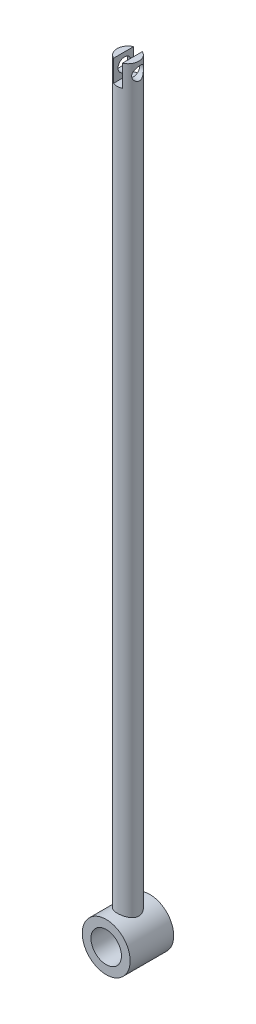
ISO-10303-21;
HEADER;
FILE_DESCRIPTION(('STEP AP214'),'2;1');
FILE_NAME('part.step','',(''),(''),'','','');
FILE_SCHEMA(('AUTOMOTIVE_DESIGN { 1 0 10303 214 1 1 1 1 }'));
ENDSEC;
DATA;
#1=APPLICATION_CONTEXT('core data for automotive mechanical design processes');
#2=APPLICATION_PROTOCOL_DEFINITION('international standard','automotive_design',2000,#1);
#3=PRODUCT_CONTEXT('',#1,'mechanical');
#4=PRODUCT('Part','Part','',(#3));
#5=PRODUCT_RELATED_PRODUCT_CATEGORY('part','',(#4));
#6=PRODUCT_DEFINITION_FORMATION('','',#4);
#7=PRODUCT_DEFINITION_CONTEXT('part definition',#1,'design');
#8=PRODUCT_DEFINITION('design','',#6,#7);
#9=PRODUCT_DEFINITION_SHAPE('','',#8);
#10=(LENGTH_UNIT() NAMED_UNIT(*) SI_UNIT(.MILLI.,.METRE.));
#11=(NAMED_UNIT(*) PLANE_ANGLE_UNIT() SI_UNIT($,.RADIAN.));
#12=(NAMED_UNIT(*) SI_UNIT($,.STERADIAN.) SOLID_ANGLE_UNIT());
#13=UNCERTAINTY_MEASURE_WITH_UNIT(LENGTH_MEASURE(1.E-05),#10,'distance_accuracy_value','');
#14=(GEOMETRIC_REPRESENTATION_CONTEXT(3) GLOBAL_UNCERTAINTY_ASSIGNED_CONTEXT((#13)) GLOBAL_UNIT_ASSIGNED_CONTEXT((#10,
#11,#12)) REPRESENTATION_CONTEXT('',''));
#15=CARTESIAN_POINT('',(0.,0.,0.));
#16=DIRECTION('',(0.,0.,1.));
#17=DIRECTION('',(1.,0.,0.));
#18=AXIS2_PLACEMENT_3D('',#15,#16,#17);
#19=CARTESIAN_POINT('',(0.,170.,5.));
#20=DIRECTION('',(0.,-1.,0.));
#21=DIRECTION('',(0.,0.,-1.));
#22=AXIS2_PLACEMENT_3D('',#19,#20,#21);
#23=CYLINDRICAL_SURFACE('',#22,2.5);
#24=CARTESIAN_POINT('',(0.,170.,5.));
#25=DIRECTION('',(0.,1.,0.));
#26=DIRECTION('',(0.,0.,1.));
#27=AXIS2_PLACEMENT_3D('',#24,#25,#26);
#28=CIRCLE('',#27,2.5);
#29=CARTESIAN_POINT('',(-1.,170.,7.29128784747792));
#30=VERTEX_POINT('',#29);
#31=CARTESIAN_POINT('',(1.,170.,7.29128784747792));
#32=VERTEX_POINT('',#31);
#33=EDGE_CURVE('E124',#30,#32,#28,.T.);
#34=ORIENTED_EDGE('',*,*,#33,.F.);
#35=DIRECTION('',(0.,-1.,0.));
#36=VECTOR('',#35,1.);
#37=CARTESIAN_POINT('',(-1.,175.,7.29128784747792));
#38=LINE('',#37,#36);
#39=CARTESIAN_POINT('',(-1.,175.,7.29128784747792));
#40=VERTEX_POINT('',#39);
#41=EDGE_CURVE('E120',#40,#30,#38,.T.);
#42=ORIENTED_EDGE('',*,*,#41,.F.);
#43=CARTESIAN_POINT('',(0.,175.,5.));
#44=DIRECTION('',(0.,1.,0.));
#45=DIRECTION('',(0.,0.,1.));
#46=AXIS2_PLACEMENT_3D('',#43,#44,#45);
#47=CIRCLE('',#46,2.5);
#48=CARTESIAN_POINT('',(-1.,175.,2.70871215252208));
#49=VERTEX_POINT('',#48);
#50=EDGE_CURVE('E106',#49,#40,#47,.T.);
#51=ORIENTED_EDGE('',*,*,#50,.F.);
#52=DIRECTION('',(0.,-1.,0.));
#53=VECTOR('',#52,1.);
#54=CARTESIAN_POINT('',(-1.,175.,2.70871215252208));
#55=LINE('',#54,#53);
#56=CARTESIAN_POINT('',(-1.,170.,2.70871215252208));
#57=VERTEX_POINT('',#56);
#58=EDGE_CURVE('E116',#49,#57,#55,.T.);
#59=ORIENTED_EDGE('',*,*,#58,.T.);
#60=CARTESIAN_POINT('',(1.,170.,2.70871215252208));
#61=VERTEX_POINT('',#60);
#62=EDGE_CURVE('E101',#61,#57,#28,.T.);
#63=ORIENTED_EDGE('',*,*,#62,.F.);
#64=DIRECTION('',(0.,-1.,0.));
#65=VECTOR('',#64,1.);
#66=CARTESIAN_POINT('',(1.,175.,2.70871215252208));
#67=LINE('',#66,#65);
#68=CARTESIAN_POINT('',(1.,175.,2.70871215252208));
#69=VERTEX_POINT('',#68);
#70=EDGE_CURVE('E58',#69,#61,#67,.T.);
#71=ORIENTED_EDGE('',*,*,#70,.F.);
#72=CARTESIAN_POINT('',(0.,175.,5.));
#73=DIRECTION('',(0.,1.,0.));
#74=DIRECTION('',(0.,0.,1.));
#75=AXIS2_PLACEMENT_3D('',#72,#73,#74);
#76=CIRCLE('',#75,2.5);
#77=CARTESIAN_POINT('',(1.,175.,7.29128784747792));
#78=VERTEX_POINT('',#77);
#79=EDGE_CURVE('E91',#78,#69,#76,.T.);
#80=ORIENTED_EDGE('',*,*,#79,.F.);
#81=DIRECTION('',(0.,-1.,0.));
#82=VECTOR('',#81,1.);
#83=CARTESIAN_POINT('',(1.,175.,7.29128784747792));
#84=LINE('',#83,#82);
#85=EDGE_CURVE('E87',#78,#32,#84,.T.);
#86=ORIENTED_EDGE('',*,*,#85,.T.);
#87=EDGE_LOOP('',(#34,#42,#51,#59,#63,#71,#80,#86));
#88=FACE_BOUND('',#87,.T.);
#89=CARTESIAN_POINT('',(0.,5.5,2.5));
#90=CARTESIAN_POINT('',(-0.132816145284357,5.49999369870931,2.50000770657968));
#91=CARTESIAN_POINT('',(-0.265835701448803,5.49513526114601,2.51064708851472));
#92=CARTESIAN_POINT('',(-0.528027896062537,5.47618102046917,2.55277708585043));
#93=CARTESIAN_POINT('',(-0.657190881556424,5.46206378775658,2.58431607542101));
#94=CARTESIAN_POINT('',(-0.907466739557298,5.42608787981103,2.66680544715223));
#95=CARTESIAN_POINT('',(-1.02860698228922,5.40425732698846,2.71768536363404));
#96=CARTESIAN_POINT('',(-1.26049169700434,5.35492606344154,2.83708941935535));
#97=CARTESIAN_POINT('',(-1.37123824747009,5.32742648991282,2.90561002058932));
#98=CARTESIAN_POINT('',(-1.58575279564469,5.26767788661504,3.06248592473316));
#99=CARTESIAN_POINT('',(-1.68884771841108,5.23525516065229,3.15169467760791));
#100=CARTESIAN_POINT('',(-1.87921167122033,5.169981608249,3.34559891012303));
#101=CARTESIAN_POINT('',(-1.96647083094001,5.13713052839629,3.45030397520704));
#102=CARTESIAN_POINT('',(-2.12798843737884,5.07244492450594,3.6799449421281));
#103=CARTESIAN_POINT('',(-2.20112759491811,5.04079497957299,3.80572580705089));
#104=CARTESIAN_POINT('',(-2.32491325493927,4.98491966737432,4.06943201918799));
#105=CARTESIAN_POINT('',(-2.37557345021863,4.96068978306032,4.20734991174338));
#106=CARTESIAN_POINT('',(-2.45005627758752,4.9243140427224,4.48369548563305));
#107=CARTESIAN_POINT('',(-2.47518302941619,4.91158514421169,4.62169158073497));
#108=CARTESIAN_POINT('',(-2.50193279260797,4.89801821463239,4.90048194541598));
#109=CARTESIAN_POINT('',(-2.50357264087074,4.89717166555205,5.04127413806362));
#110=CARTESIAN_POINT('',(-2.48427141198996,4.90698153027191,5.30741072026334));
#111=CARTESIAN_POINT('',(-2.46545016283118,4.91655818122591,5.43295732955884));
#112=CARTESIAN_POINT('',(-2.4093676508794,4.94428109958009,5.6788660765093));
#113=CARTESIAN_POINT('',(-2.37210198697065,4.96242941226084,5.79922696931906));
#114=CARTESIAN_POINT('',(-2.27945184779561,5.0056720821879,6.03463657988821));
#115=CARTESIAN_POINT('',(-2.22367420519436,5.03091516285485,6.14950198601082));
#116=CARTESIAN_POINT('',(-2.09586859273949,5.08548488907163,6.3687414552682));
#117=CARTESIAN_POINT('',(-2.02383365211919,5.11481328424216,6.47311099017509));
#118=CARTESIAN_POINT('',(-1.85692478057703,5.17789221587211,6.67964656522397));
#119=CARTESIAN_POINT('',(-1.76046753299936,5.2117880598316,6.78049273353465));
#120=CARTESIAN_POINT('',(-1.55174815249174,5.27769368397502,6.96506827328681));
#121=CARTESIAN_POINT('',(-1.43948082103431,5.30970283886444,7.04879199238651));
#122=CARTESIAN_POINT('',(-1.19766281925566,5.36950534618767,7.19920668395963));
#123=CARTESIAN_POINT('',(-1.06767206685173,5.39712978524095,7.26526247902372));
#124=CARTESIAN_POINT('',(-0.796844896081458,5.44369936052484,7.37408839587899));
#125=CARTESIAN_POINT('',(-0.656015701378205,5.46265022004357,7.41687387617979));
#126=CARTESIAN_POINT('',(-0.378449914355492,5.48860490400602,7.47495536936345));
#127=CARTESIAN_POINT('',(-0.242154484202898,5.49637394767751,7.49201639920862));
#128=CARTESIAN_POINT('',(0.0315660436282488,5.50161007334277,7.50354688446092));
#129=CARTESIAN_POINT('',(0.168990715716221,5.49908087348691,7.49802449354217));
#130=CARTESIAN_POINT('',(0.432146778493067,5.48448407938737,7.4657141909571));
#131=CARTESIAN_POINT('',(0.558078127396233,5.47301153257062,7.44025247846056));
#132=CARTESIAN_POINT('',(0.803693463481533,5.44237110560927,7.37073267387439));
#133=CARTESIAN_POINT('',(0.923376701955515,5.42320230560714,7.32667235884421));
#134=CARTESIAN_POINT('',(1.15732747516372,5.37821815950354,7.21983025191788));
#135=CARTESIAN_POINT('',(1.27131180951637,5.35221506502489,7.15651006512357));
#136=CARTESIAN_POINT('',(1.48744614928834,5.29622400098564,7.013532445334));
#137=CARTESIAN_POINT('',(1.58959093424205,5.26623428600456,6.93386784808692));
#138=CARTESIAN_POINT('',(1.78819128612951,5.2023213866395,6.75268934687502));
#139=CARTESIAN_POINT('',(1.88345063650186,5.16827928194194,6.64990310925036));
#140=CARTESIAN_POINT('',(2.05579555974773,5.10218027178943,6.42943763375986));
#141=CARTESIAN_POINT('',(2.13287371467411,5.0701241805496,6.31175234705524));
#142=CARTESIAN_POINT('',(2.26851417742739,5.01093675854131,6.06054583116627));
#143=CARTESIAN_POINT('',(2.32651178086012,4.98396428661225,5.92667925579803));
#144=CARTESIAN_POINT('',(2.41857144488097,4.93995555801825,5.6494505865758));
#145=CARTESIAN_POINT('',(2.45265831910444,4.9229090037493,5.50609850603875));
#146=CARTESIAN_POINT('',(2.49325807507769,4.90246200756536,5.2274373803254));
#147=CARTESIAN_POINT('',(2.5019188531559,4.89799994349808,5.09251907739777));
#148=CARTESIAN_POINT('',(2.49737021161822,4.90032179261342,4.82316690852988));
#149=CARTESIAN_POINT('',(2.48416607010203,4.90710299172004,4.68873293352526));
#150=CARTESIAN_POINT('',(2.4381684933062,4.93010341873286,4.43337370386282));
#151=CARTESIAN_POINT('',(2.40671995185147,4.94567287009982,4.31214138124329));
#152=CARTESIAN_POINT('',(2.32658661605855,4.98386936157557,4.07670718572974));
#153=CARTESIAN_POINT('',(2.2778967772596,5.00649846696794,3.96250738190245));
#154=CARTESIAN_POINT('',(2.1610419547488,5.05808484439916,3.73621296097084));
#155=CARTESIAN_POINT('',(2.09181431853015,5.08735847849273,3.62474088289736));
#156=CARTESIAN_POINT('',(1.93719380028804,5.14822130854099,3.41433129072047));
#157=CARTESIAN_POINT('',(1.85179378769227,5.17981152212113,3.31539933793318));
#158=CARTESIAN_POINT('',(1.65784520472974,5.2452790147138,3.12333979866508));
#159=CARTESIAN_POINT('',(1.54788097332246,5.27909503785502,3.03161259442945));
#160=CARTESIAN_POINT('',(1.31300676588176,5.34236067072088,2.86773851077349));
#161=CARTESIAN_POINT('',(1.18808990453652,5.3718082548044,2.79560070214091));
#162=CARTESIAN_POINT('',(0.927398695048436,5.42285296457391,2.67397870975514));
#163=CARTESIAN_POINT('',(0.791729654695489,5.44451694348196,2.6243006157715));
#164=CARTESIAN_POINT('',(0.582817222347262,5.46948623676269,2.56781082539488));
#165=CARTESIAN_POINT('',(0.512336727590824,5.4765522405717,2.55199091419621));
#166=CARTESIAN_POINT('',(0.370074071775207,5.48799750884364,2.52648988951803));
#167=CARTESIAN_POINT('',(0.298292830256239,5.49237860050235,2.51680460101854));
#168=CARTESIAN_POINT('',(0.18861229497853,5.49689395714262,2.50683913684737));
#169=CARTESIAN_POINT('',(0.150946407387661,5.49805724033138,2.50427613909589));
#170=CARTESIAN_POINT('',(0.0755258311084194,5.49961116371431,2.50085546170958));
#171=CARTESIAN_POINT('',(0.0377711410607123,5.50000179200306,2.49999780835148));
#172=CARTESIAN_POINT('',(0.,5.5,2.5));
#173=B_SPLINE_CURVE_WITH_KNOTS('',3,(#89,#90,#91,#92,#93,#94,#95,#96,#97,#98,#99,#100,#101,#102,
#103,#104,#105,#106,#107,#108,#109,#110,#111,#112,#113,#114,#115,#116,#117,#118,#119,#120,#121,
#122,#123,#124,#125,#126,#127,#128,#129,#130,#131,#132,#133,#134,#135,#136,#137,#138,#139,#140,
#141,#142,#143,#144,#145,#146,#147,#148,#149,#150,#151,#152,#153,#154,#155,#156,#157,#158,#159,
#160,#161,#162,#163,#164,#165,#166,#167,#168,#169,#170,#171,#172),.UNSPECIFIED.,.T.,.F.,(4,2,2,
2,2,2,2,2,2,2,2,2,2,2,2,2,2,2,2,2,2,2,2,2,2,2,2,2,2,2,2,2,2,2,2,2,2,2,2,2,2,4),(0.,
0.398300931001202,0.797527003400661,1.19531228574912,1.59301785057736,2.01163405819865,
2.43051029696777,2.8749655137827,3.31914962297436,3.73929338084823,4.15913593798615,
4.53929253779887,4.91953989247825,5.30844370198958,5.6975145826618,6.1264236824533,
6.55547414294633,6.99833839939004,7.44091000768855,7.85145915894037,8.26186009578161,
8.6470684559661,9.03232287003282,9.42952911220836,9.8269098353609,10.2576285831247,
10.6885227618009,11.1312140224167,11.5734451926766,11.9770599127743,12.3805772161773,
12.7575667492601,13.1346666732434,13.5363493613727,13.9382095697602,14.3775242869152,
14.8170420813821,15.2526891454276,15.4701654657451,15.6874936194379,15.800763348909,
15.9140348236778),.UNSPECIFIED.);
#174=CARTESIAN_POINT('',(0.,5.5,2.5));
#175=VERTEX_POINT('',#174);
#176=EDGE_CURVE('E11',#175,#175,#173,.T.);
#177=ORIENTED_EDGE('',*,*,#176,.T.);
#178=EDGE_LOOP('',(#177));
#179=FACE_BOUND('',#178,.T.);
#180=CARTESIAN_POINT('',(-2.14069514292807,172.5,6.29128784747793));
#181=CARTESIAN_POINT('',(-2.14070141830382,172.578027632267,6.29128329138601));
#182=CARTESIAN_POINT('',(-2.14443172397127,172.656186680594,6.28515447906656));
#183=CARTESIAN_POINT('',(-2.15873931679595,172.81009087785,6.26096392507642));
#184=CARTESIAN_POINT('',(-2.16933502272238,172.885828956453,6.2428700804453));
#185=CARTESIAN_POINT('',(-2.1956532071937,173.032320807087,6.1957520457726));
#186=CARTESIAN_POINT('',(-2.21134433875949,173.103101917198,6.16679452391612));
#187=CARTESIAN_POINT('',(-2.24584632739405,173.238829145625,6.09891758617039));
#188=CARTESIAN_POINT('',(-2.26465708655064,173.303775446973,6.05999848291304));
#189=CARTESIAN_POINT('',(-2.30512689765842,173.43252867305,5.96906352136546));
#190=CARTESIAN_POINT('',(-2.32688911323996,173.495688327511,5.91617548523756));
#191=CARTESIAN_POINT('',(-2.36917081031949,173.612761413411,5.8005135365687));
#192=CARTESIAN_POINT('',(-2.38968965860018,173.666670158761,5.73773464447404));
#193=CARTESIAN_POINT('',(-2.42806664392425,173.766398912422,5.59988886945598));
#194=CARTESIAN_POINT('',(-2.44573030621819,173.811650724033,5.52435200419287));
#195=CARTESIAN_POINT('',(-2.47444945856696,173.888541251422,5.36549693614796));
#196=CARTESIAN_POINT('',(-2.48551185963301,173.920194194406,5.2821869772682));
#197=CARTESIAN_POINT('',(-2.49833844508071,173.965844524357,5.11945144185434));
#198=CARTESIAN_POINT('',(-2.50094225336532,173.981323467121,5.04050822693958));
#199=CARTESIAN_POINT('',(-2.49844626996597,173.999435374382,4.88129709342823));
#200=CARTESIAN_POINT('',(-2.49335062264703,174.002075246506,4.80102991047837));
#201=CARTESIAN_POINT('',(-2.4763295237764,173.995009006545,4.64912658957882));
#202=CARTESIAN_POINT('',(-2.46505698287968,173.986387980334,4.57736154606894));
#203=CARTESIAN_POINT('',(-2.43681120920132,173.959289269121,4.43689597817315));
#204=CARTESIAN_POINT('',(-2.41983684353516,173.9408096249,4.36819606586755));
#205=CARTESIAN_POINT('',(-2.3803052558832,173.893887131649,4.23228763258643));
#206=CARTESIAN_POINT('',(-2.35753078598515,173.865032556234,4.1652860852334));
#207=CARTESIAN_POINT('',(-2.30820672936686,173.798701231144,4.03724529411199));
#208=CARTESIAN_POINT('',(-2.28165622583113,173.761222386139,3.97620750442491));
#209=CARTESIAN_POINT('',(-2.22219304070417,173.672563579143,3.85228885977368));
#210=CARTESIAN_POINT('',(-2.18891761237375,173.620181796299,3.79044207151836));
#211=CARTESIAN_POINT('',(-2.12165986951438,173.50631144035,3.67599880862024));
#212=CARTESIAN_POINT('',(-2.08767623758627,173.444804291757,3.62342169247748));
#213=CARTESIAN_POINT('',(-2.01763308900464,173.305112313312,3.52237359163978));
#214=CARTESIAN_POINT('',(-1.98184913319329,173.225803028469,3.47524826358308));
#215=CARTESIAN_POINT('',(-1.9179617268387,173.057409660917,3.39561844701404));
#216=CARTESIAN_POINT('',(-1.88983206881609,172.968360433648,3.36306381662737));
#217=CARTESIAN_POINT('',(-1.85459969626499,172.815092336877,3.32342567272736));
#218=CARTESIAN_POINT('',(-1.84358512812127,172.753045179876,3.31141857434128));
#219=CARTESIAN_POINT('',(-1.82873407058471,172.627120917551,3.29534231177016));
#220=CARTESIAN_POINT('',(-1.82488719788205,172.563246595615,3.29126166475668));
#221=CARTESIAN_POINT('',(-1.8249365170057,172.435414412714,3.29131432726677));
#222=CARTESIAN_POINT('',(-1.82884380541813,172.371456563111,3.2954594082115));
#223=CARTESIAN_POINT('',(-1.84382994385271,172.245385444588,3.31168522876542));
#224=CARTESIAN_POINT('',(-1.85491831054758,172.183274737989,3.32377649932006));
#225=CARTESIAN_POINT('',(-1.88630447936951,172.047301412972,3.35910477956824));
#226=CARTESIAN_POINT('',(-1.90820364940758,171.974341333442,3.38436144790111));
#227=CARTESIAN_POINT('',(-1.95771307392423,171.834734127828,3.44472576812642));
#228=CARTESIAN_POINT('',(-1.98533132720073,171.768096036183,3.47984724187368));
#229=CARTESIAN_POINT('',(-2.04399165011587,171.640435903258,3.5596532600339));
#230=CARTESIAN_POINT('',(-2.07509013107739,171.579549235452,3.60451144896121));
#231=CARTESIAN_POINT('',(-2.13783016478279,171.465315226709,3.7026642745302));
#232=CARTESIAN_POINT('',(-2.16947191572369,171.411970705798,3.75596205104588));
#233=CARTESIAN_POINT('',(-2.2375279195485,171.303453308029,3.88214770508867));
#234=CARTESIAN_POINT('',(-2.27360532483994,171.250111822915,3.95681558127685));
#235=CARTESIAN_POINT('',(-2.34026588714046,171.157192363301,4.1164793295706));
#236=CARTESIAN_POINT('',(-2.3708551789316,171.11759897384,4.20146348931704));
#237=CARTESIAN_POINT('',(-2.41765252451377,171.061602919094,4.35957010283165));
#238=CARTESIAN_POINT('',(-2.43554779760682,171.04198654959,4.43105810258579));
#239=CARTESIAN_POINT('',(-2.46514416227022,171.013467215756,4.57736822904704));
#240=CARTESIAN_POINT('',(-2.4768504476628,171.004555260225,4.65218750277577));
#241=CARTESIAN_POINT('',(-2.49341215667729,170.998137680654,4.80330383085204));
#242=CARTESIAN_POINT('',(-2.49824741460185,171.000665540716,4.87960457160536));
#243=CARTESIAN_POINT('',(-2.50095442492037,171.017328718079,5.03105915946419));
#244=CARTESIAN_POINT('',(-2.49882525965686,171.031465564836,5.10621285411995));
#245=CARTESIAN_POINT('',(-2.4884880927595,171.06993645159,5.2497584555153));
#246=CARTESIAN_POINT('',(-2.48055685929708,171.093784986095,5.31830245455973));
#247=CARTESIAN_POINT('',(-2.45996284598952,171.150757626301,5.45063515250131));
#248=CARTESIAN_POINT('',(-2.44729925799655,171.183883316027,5.51442303696007));
#249=CARTESIAN_POINT('',(-2.41750229297507,171.261138194188,5.64044766305601));
#250=CARTESIAN_POINT('',(-2.40011268490799,171.305888038785,5.70224182578551));
#251=CARTESIAN_POINT('',(-2.3631636522671,171.403834849555,5.81802083107956));
#252=CARTESIAN_POINT('',(-2.34360257054352,171.457038280584,5.87199963599639));
#253=CARTESIAN_POINT('',(-2.30187437252361,171.577652088917,5.97721197922381));
#254=CARTESIAN_POINT('',(-2.27967302308833,171.645998814883,6.02736298251089));
#255=CARTESIAN_POINT('',(-2.23775300854055,171.790756522194,6.11573338687229));
#256=CARTESIAN_POINT('',(-2.21803429646778,171.867167350951,6.15395301365445));
#257=CARTESIAN_POINT('',(-2.18623474008605,172.015959811978,6.21299341231143));
#258=CARTESIAN_POINT('',(-2.17349124869877,172.087554874629,6.23543897990486));
#259=CARTESIAN_POINT('',(-2.1538364361929,172.233948285747,6.26940333757745));
#260=CARTESIAN_POINT('',(-2.14690752450749,172.308736248141,6.28095509738783));
#261=CARTESIAN_POINT('',(-2.14249861806857,172.403297927718,6.28829336353644));
#262=CARTESIAN_POINT('',(-2.1418239191606,172.422611738351,6.28941508870397));
#263=CARTESIAN_POINT('',(-2.14092137167742,172.461280997951,6.29091294815256));
#264=CARTESIAN_POINT('',(-2.1406935856139,172.480636452365,6.29128897812998));
#265=CARTESIAN_POINT('',(-2.14069514292807,172.5,6.29128784747793));
#266=B_SPLINE_CURVE_WITH_KNOTS('',3,(#180,#181,#182,#183,#184,#185,#186,#187,#188,#189,#190,
#191,#192,#193,#194,#195,#196,#197,#198,#199,#200,#201,#202,#203,#204,#205,#206,#207,#208,#209,
#210,#211,#212,#213,#214,#215,#216,#217,#218,#219,#220,#221,#222,#223,#224,#225,#226,#227,#228,
#229,#230,#231,#232,#233,#234,#235,#236,#237,#238,#239,#240,#241,#242,#243,#244,#245,#246,#247,
#248,#249,#250,#251,#252,#253,#254,#255,#256,#257,#258,#259,#260,#261,#262,#263,#264,#265),
.UNSPECIFIED.,.T.,.F.,(4,2,2,2,2,2,2,2,2,2,2,2,2,2,2,2,2,2,2,2,2,2,2,2,2,2,2,2,2,2,2,2,2,2,2,2,
2,2,2,2,2,2,4),(0.,0.23399896488917,0.468628325535289,0.701840760412903,0.935045877104088,
1.18957619904431,1.44423507624161,1.71216991200239,1.97982374627568,2.21993712000256,
2.45992129459154,2.67840129022264,2.89692472092292,3.12530286379603,3.35373655151683,
3.61555117243449,3.87790624426834,4.173220743506,4.46751101809187,4.65916323090611,
4.85053759484437,5.04218602240172,5.23408895183829,5.47355313688869,5.71335453012613,
5.95784726157174,6.20243116902311,6.49671829167429,6.7906743732143,7.01847903056038,
7.2460922086828,7.47437203601842,7.70268194353769,7.92075763220176,8.13887057885025,
8.37269213109375,8.60669336603062,8.86841225566174,9.13012619401263,9.357504783203,
9.58419298942111,9.64225468278683,9.70032449692314),.UNSPECIFIED.);
#267=CARTESIAN_POINT('',(-2.14069514292807,172.5,6.29128784747793));
#268=VERTEX_POINT('',#267);
#269=EDGE_CURVE('E146',#268,#268,#266,.T.);
#270=ORIENTED_EDGE('',*,*,#269,.F.);
#271=EDGE_LOOP('',(#270));
#272=FACE_BOUND('',#271,.T.);
#273=CARTESIAN_POINT('',(2.14069514292807,172.5,6.29128784747793));
#274=CARTESIAN_POINT('',(2.14070141830382,172.421972367733,6.29128329138601));
#275=CARTESIAN_POINT('',(2.14443172397127,172.343813319406,6.28515447906656));
#276=CARTESIAN_POINT('',(2.15873931679595,172.18990912215,6.26096392507642));
#277=CARTESIAN_POINT('',(2.16933502272238,172.114171043548,6.24287008044529));
#278=CARTESIAN_POINT('',(2.1956532071937,171.967679192913,6.1957520457726));
#279=CARTESIAN_POINT('',(2.21134433875949,171.896898082802,6.16679452391612));
#280=CARTESIAN_POINT('',(2.24584632739405,171.761170854375,6.09891758617039));
#281=CARTESIAN_POINT('',(2.26465708655064,171.696224553027,6.05999848291304));
#282=CARTESIAN_POINT('',(2.30512689765842,171.56747132695,5.96906352136546));
#283=CARTESIAN_POINT('',(2.32688911323996,171.504311672489,5.91617548523756));
#284=CARTESIAN_POINT('',(2.36917081031949,171.387238586589,5.8005135365687));
#285=CARTESIAN_POINT('',(2.38968965860018,171.333329841239,5.73773464447404));
#286=CARTESIAN_POINT('',(2.42806664392425,171.233601087578,5.59988886945598));
#287=CARTESIAN_POINT('',(2.44573030621819,171.188349275967,5.52435200419287));
#288=CARTESIAN_POINT('',(2.47444945856696,171.111458748578,5.36549693614796));
#289=CARTESIAN_POINT('',(2.48551185963301,171.079805805594,5.2821869772682));
#290=CARTESIAN_POINT('',(2.49833844508071,171.034155475643,5.11945144185434));
#291=CARTESIAN_POINT('',(2.50094225336532,171.018676532879,5.04050822693958));
#292=CARTESIAN_POINT('',(2.49844626996597,171.000564625618,4.88129709342823));
#293=CARTESIAN_POINT('',(2.49335062264703,170.997924753494,4.80102991047837));
#294=CARTESIAN_POINT('',(2.4763295237764,171.004990993455,4.64912658957882));
#295=CARTESIAN_POINT('',(2.46505698287968,171.013612019666,4.57736154606894));
#296=CARTESIAN_POINT('',(2.43681120920132,171.040710730879,4.43689597817315));
#297=CARTESIAN_POINT('',(2.41983684353516,171.0591903751,4.36819606586755));
#298=CARTESIAN_POINT('',(2.3803052558832,171.106112868351,4.23228763258643));
#299=CARTESIAN_POINT('',(2.35753078598515,171.134967443766,4.16528608523342));
#300=CARTESIAN_POINT('',(2.30820672936687,171.201298768856,4.037245294112));
#301=CARTESIAN_POINT('',(2.28165622583113,171.238777613861,3.97620750442491));
#302=CARTESIAN_POINT('',(2.22219304070417,171.327436420857,3.85228885977368));
#303=CARTESIAN_POINT('',(2.18891761237375,171.379818203702,3.79044207151836));
#304=CARTESIAN_POINT('',(2.12165986951438,171.49368855965,3.67599880862024));
#305=CARTESIAN_POINT('',(2.08767623758627,171.555195708243,3.62342169247748));
#306=CARTESIAN_POINT('',(2.01763308900464,171.694887686688,3.52237359163978));
#307=CARTESIAN_POINT('',(1.98184913319329,171.774196971531,3.47524826358308));
#308=CARTESIAN_POINT('',(1.9179617268387,171.942590339083,3.39561844701404));
#309=CARTESIAN_POINT('',(1.88983206881609,172.031639566352,3.36306381662737));
#310=CARTESIAN_POINT('',(1.85459969626499,172.184907663123,3.32342567272736));
#311=CARTESIAN_POINT('',(1.84358512812127,172.246954820124,3.31141857434128));
#312=CARTESIAN_POINT('',(1.82873407058471,172.372879082449,3.29534231177016));
#313=CARTESIAN_POINT('',(1.82488719788205,172.436753404385,3.29126166475668));
#314=CARTESIAN_POINT('',(1.8249365170057,172.564585587286,3.29131432726677));
#315=CARTESIAN_POINT('',(1.82884380541813,172.628543436889,3.2954594082115));
#316=CARTESIAN_POINT('',(1.84382994385271,172.754614555412,3.31168522876542));
#317=CARTESIAN_POINT('',(1.85491831054758,172.816725262011,3.32377649932006));
#318=CARTESIAN_POINT('',(1.88630447936951,172.952698587028,3.35910477956824));
#319=CARTESIAN_POINT('',(1.90820364940758,173.025658666558,3.38436144790111));
#320=CARTESIAN_POINT('',(1.95771307392423,173.165265872172,3.44472576812642));
#321=CARTESIAN_POINT('',(1.98533132720073,173.231903963817,3.47984724187368));
#322=CARTESIAN_POINT('',(2.04399165011587,173.359564096742,3.5596532600339));
#323=CARTESIAN_POINT('',(2.07509013107739,173.420450764548,3.60451144896121));
#324=CARTESIAN_POINT('',(2.13783016478279,173.534684773291,3.7026642745302));
#325=CARTESIAN_POINT('',(2.16947191572369,173.588029294202,3.75596205104587));
#326=CARTESIAN_POINT('',(2.2375279195485,173.696546691971,3.88214770508867));
#327=CARTESIAN_POINT('',(2.27360532483994,173.749888177085,3.95681558127685));
#328=CARTESIAN_POINT('',(2.34026588714046,173.842807636699,4.1164793295706));
#329=CARTESIAN_POINT('',(2.3708551789316,173.88240102616,4.20146348931704));
#330=CARTESIAN_POINT('',(2.41765252451377,173.938397080907,4.35957010283164));
#331=CARTESIAN_POINT('',(2.43554779760682,173.95801345041,4.43105810258578));
#332=CARTESIAN_POINT('',(2.46514416227022,173.986532784244,4.57736822904704));
#333=CARTESIAN_POINT('',(2.4768504476628,173.995444739775,4.65218750277577));
#334=CARTESIAN_POINT('',(2.49341215667729,174.001862319346,4.80330383085204));
#335=CARTESIAN_POINT('',(2.49824741460185,173.999334459284,4.87960457160536));
#336=CARTESIAN_POINT('',(2.50095442492037,173.982671281921,5.03105915946419));
#337=CARTESIAN_POINT('',(2.49882525965686,173.968534435164,5.10621285411995));
#338=CARTESIAN_POINT('',(2.4884880927595,173.93006354841,5.2497584555153));
#339=CARTESIAN_POINT('',(2.48055685929708,173.906215013905,5.31830245455973));
#340=CARTESIAN_POINT('',(2.45996284598952,173.849242373699,5.45063515250131));
#341=CARTESIAN_POINT('',(2.44729925799655,173.816116683973,5.51442303696007));
#342=CARTESIAN_POINT('',(2.41750229297507,173.738861805812,5.64044766305601));
#343=CARTESIAN_POINT('',(2.40011268490799,173.694111961215,5.70224182578551));
#344=CARTESIAN_POINT('',(2.3631636522671,173.596165150445,5.81802083107956));
#345=CARTESIAN_POINT('',(2.34360257054352,173.542961719416,5.87199963599639));
#346=CARTESIAN_POINT('',(2.30187437252361,173.422347911083,5.97721197922382));
#347=CARTESIAN_POINT('',(2.27967302308833,173.354001185117,6.0273629825109));
#348=CARTESIAN_POINT('',(2.23775300854054,173.209243477806,6.1157333868723));
#349=CARTESIAN_POINT('',(2.21803429646778,173.132832649049,6.15395301365446));
#350=CARTESIAN_POINT('',(2.18623474008605,172.984040188022,6.21299341231143));
#351=CARTESIAN_POINT('',(2.17349124869877,172.912445125371,6.23543897990486));
#352=CARTESIAN_POINT('',(2.1538364361929,172.766051714253,6.26940333757745));
#353=CARTESIAN_POINT('',(2.14690752450749,172.691263751859,6.28095509738783));
#354=CARTESIAN_POINT('',(2.14249861806857,172.596702072282,6.28829336353644));
#355=CARTESIAN_POINT('',(2.1418239191606,172.577388261649,6.28941508870396));
#356=CARTESIAN_POINT('',(2.14092137167742,172.538719002049,6.29091294815256));
#357=CARTESIAN_POINT('',(2.1406935856139,172.519363547635,6.29128897812998));
#358=CARTESIAN_POINT('',(2.14069514292807,172.5,6.29128784747793));
#359=B_SPLINE_CURVE_WITH_KNOTS('',3,(#273,#274,#275,#276,#277,#278,#279,#280,#281,#282,#283,
#284,#285,#286,#287,#288,#289,#290,#291,#292,#293,#294,#295,#296,#297,#298,#299,#300,#301,#302,
#303,#304,#305,#306,#307,#308,#309,#310,#311,#312,#313,#314,#315,#316,#317,#318,#319,#320,#321,
#322,#323,#324,#325,#326,#327,#328,#329,#330,#331,#332,#333,#334,#335,#336,#337,#338,#339,#340,
#341,#342,#343,#344,#345,#346,#347,#348,#349,#350,#351,#352,#353,#354,#355,#356,#357,#358),
.UNSPECIFIED.,.T.,.F.,(4,2,2,2,2,2,2,2,2,2,2,2,2,2,2,2,2,2,2,2,2,2,2,2,2,2,2,2,2,2,2,2,2,2,2,2,
2,2,2,2,2,2,4),(0.,0.233998964889198,0.468628325535289,0.701840760412903,0.935045877104088,
1.18957619904431,1.44423507624161,1.71216991200239,1.97982374627568,2.21993712000256,
2.45992129459154,2.67840129022264,2.89692472092292,3.12530286379601,3.35373655151683,
3.61555117243449,3.87790624426834,4.173220743506,4.46751101809187,4.6591632309061,
4.85053759484437,5.04218602240171,5.23408895183829,5.47355313688868,5.71335453012613,
5.95784726157173,6.20243116902311,6.49671829167429,6.7906743732143,7.01847903056037,
7.2460922086828,7.47437203601842,7.70268194353769,7.92075763220176,8.13887057885025,
8.37269213109375,8.60669336603062,8.86841225566177,9.13012619401263,9.357504783203,
9.58419298942111,9.64225468278672,9.70032449692314),.UNSPECIFIED.);
#360=CARTESIAN_POINT('',(2.14069514292807,172.5,6.29128784747793));
#361=VERTEX_POINT('',#360);
#362=EDGE_CURVE('E154',#361,#361,#359,.T.);
#363=ORIENTED_EDGE('',*,*,#362,.F.);
#364=EDGE_LOOP('',(#363));
#365=FACE_BOUND('',#364,.T.);
#366=ADVANCED_FACE('F39',(#88,#179,#272,#365),#23,.T.);
#367=CARTESIAN_POINT('',(0.,170.,5.));
#368=DIRECTION('',(0.,1.,0.));
#369=DIRECTION('',(0.,0.,1.));
#370=AXIS2_PLACEMENT_3D('',#367,#368,#369);
#371=PLANE('',#370);
#372=ORIENTED_EDGE('',*,*,#33,.T.);
#373=DIRECTION('',(0.,0.,1.));
#374=VECTOR('',#373,1.);
#375=CARTESIAN_POINT('',(1.,170.,7.29128784747792));
#376=LINE('',#375,#374);
#377=EDGE_CURVE('E96',#61,#32,#376,.T.);
#378=ORIENTED_EDGE('',*,*,#377,.F.);
#379=ORIENTED_EDGE('',*,*,#62,.T.);
#380=DIRECTION('',(0.,0.,-1.));
#381=VECTOR('',#380,1.);
#382=CARTESIAN_POINT('',(-1.,170.,7.29128784747792));
#383=LINE('',#382,#381);
#384=EDGE_CURVE('E66',#30,#57,#383,.T.);
#385=ORIENTED_EDGE('',*,*,#384,.F.);
#386=EDGE_LOOP('',(#372,#378,#379,#385));
#387=FACE_BOUND('',#386,.T.);
#388=ADVANCED_FACE('F138',(#387),#371,.T.);
#389=CARTESIAN_POINT('',(0.,0.,10.));
#390=DIRECTION('',(0.,0.,-1.));
#391=DIRECTION('',(-1.,0.,0.));
#392=AXIS2_PLACEMENT_3D('',#389,#390,#391);
#393=CYLINDRICAL_SURFACE('',#392,5.5);
#394=CARTESIAN_POINT('',(0.,0.,10.));
#395=DIRECTION('',(0.,0.,1.));
#396=DIRECTION('',(1.,0.,0.));
#397=AXIS2_PLACEMENT_3D('',#394,#395,#396);
#398=CIRCLE('',#397,5.5);
#399=CARTESIAN_POINT('',(5.5,0.,10.));
#400=VERTEX_POINT('',#399);
#401=EDGE_CURVE('E50',#400,#400,#398,.T.);
#402=ORIENTED_EDGE('',*,*,#401,.F.);
#403=EDGE_LOOP('',(#402));
#404=FACE_BOUND('',#403,.T.);
#405=CARTESIAN_POINT('',(0.,0.,0.));
#406=DIRECTION('',(0.,0.,1.));
#407=DIRECTION('',(1.,0.,0.));
#408=AXIS2_PLACEMENT_3D('',#405,#406,#407);
#409=CIRCLE('',#408,5.5);
#410=CARTESIAN_POINT('',(5.5,0.,0.));
#411=VERTEX_POINT('',#410);
#412=EDGE_CURVE('E273',#411,#411,#409,.T.);
#413=ORIENTED_EDGE('',*,*,#412,.T.);
#414=EDGE_LOOP('',(#413));
#415=FACE_BOUND('',#414,.T.);
#416=ORIENTED_EDGE('',*,*,#176,.F.);
#417=EDGE_LOOP('',(#416));
#418=FACE_BOUND('',#417,.T.);
#419=ADVANCED_FACE('F41',(#404,#415,#418),#393,.T.);
#420=CARTESIAN_POINT('',(0.,0.,10.));
#421=DIRECTION('',(0.,0.,-1.));
#422=DIRECTION('',(-1.,0.,0.));
#423=AXIS2_PLACEMENT_3D('',#420,#421,#422);
#424=CYLINDRICAL_SURFACE('',#423,3.5);
#425=CARTESIAN_POINT('',(0.,0.,0.));
#426=DIRECTION('',(0.,0.,1.));
#427=DIRECTION('',(1.,0.,0.));
#428=AXIS2_PLACEMENT_3D('',#425,#426,#427);
#429=CIRCLE('',#428,3.5);
#430=CARTESIAN_POINT('',(3.5,0.,0.));
#431=VERTEX_POINT('',#430);
#432=EDGE_CURVE('E126',#431,#431,#429,.T.);
#433=ORIENTED_EDGE('',*,*,#432,.F.);
#434=EDGE_LOOP('',(#433));
#435=FACE_BOUND('',#434,.T.);
#436=CARTESIAN_POINT('',(0.,0.,10.));
#437=DIRECTION('',(0.,0.,1.));
#438=DIRECTION('',(1.,0.,0.));
#439=AXIS2_PLACEMENT_3D('',#436,#437,#438);
#440=CIRCLE('',#439,3.5);
#441=CARTESIAN_POINT('',(3.5,0.,10.));
#442=VERTEX_POINT('',#441);
#443=EDGE_CURVE('E132',#442,#442,#440,.T.);
#444=ORIENTED_EDGE('',*,*,#443,.T.);
#445=EDGE_LOOP('',(#444));
#446=FACE_BOUND('',#445,.T.);
#447=ADVANCED_FACE('F140',(#435,#446),#424,.F.);
#448=CARTESIAN_POINT('',(0.,0.,10.));
#449=DIRECTION('',(0.,0.,1.));
#450=DIRECTION('',(1.,0.,0.));
#451=AXIS2_PLACEMENT_3D('',#448,#449,#450);
#452=PLANE('',#451);
#453=ORIENTED_EDGE('',*,*,#401,.T.);
#454=EDGE_LOOP('',(#453));
#455=FACE_BOUND('',#454,.T.);
#456=ORIENTED_EDGE('',*,*,#443,.F.);
#457=EDGE_LOOP('',(#456));
#458=FACE_BOUND('',#457,.T.);
#459=ADVANCED_FACE('F181',(#455,#458),#452,.T.);
#460=CARTESIAN_POINT('',(0.,0.,0.));
#461=DIRECTION('',(0.,0.,1.));
#462=DIRECTION('',(1.,0.,0.));
#463=AXIS2_PLACEMENT_3D('',#460,#461,#462);
#464=PLANE('',#463);
#465=ORIENTED_EDGE('',*,*,#412,.F.);
#466=EDGE_LOOP('',(#465));
#467=FACE_BOUND('',#466,.T.);
#468=ORIENTED_EDGE('',*,*,#432,.T.);
#469=EDGE_LOOP('',(#468));
#470=FACE_BOUND('',#469,.T.);
#471=ADVANCED_FACE('F176',(#467,#470),#464,.F.);
#472=CARTESIAN_POINT('',(-1.,175.,7.29128784747792));
#473=DIRECTION('',(-1.,0.,0.));
#474=DIRECTION('',(0.,0.,1.));
#475=AXIS2_PLACEMENT_3D('',#472,#473,#474);
#476=PLANE('',#475);
#477=CARTESIAN_POINT('',(-1.,172.5,4.79128784747793));
#478=DIRECTION('',(-1.,0.,0.));
#479=DIRECTION('',(0.,0.,1.));
#480=AXIS2_PLACEMENT_3D('',#477,#478,#479);
#481=CIRCLE('',#480,1.5);
#482=CARTESIAN_POINT('',(-1.,172.5,6.29128784747793));
#483=VERTEX_POINT('',#482);
#484=EDGE_CURVE('E155',#483,#483,#481,.F.);
#485=ORIENTED_EDGE('',*,*,#484,.F.);
#486=EDGE_LOOP('',(#485));
#487=FACE_BOUND('',#486,.T.);
#488=ORIENTED_EDGE('',*,*,#384,.T.);
#489=ORIENTED_EDGE('',*,*,#58,.F.);
#490=DIRECTION('',(0.,0.,-1.));
#491=VECTOR('',#490,1.);
#492=CARTESIAN_POINT('',(-1.,175.,7.29128784747792));
#493=LINE('',#492,#491);
#494=EDGE_CURVE('E114',#40,#49,#493,.T.);
#495=ORIENTED_EDGE('',*,*,#494,.F.);
#496=ORIENTED_EDGE('',*,*,#41,.T.);
#497=EDGE_LOOP('',(#488,#489,#495,#496));
#498=FACE_BOUND('',#497,.T.);
#499=ADVANCED_FACE('F173',(#487,#498),#476,.F.);
#500=CARTESIAN_POINT('',(0.,175.,5.));
#501=DIRECTION('',(0.,1.,0.));
#502=DIRECTION('',(0.,0.,1.));
#503=AXIS2_PLACEMENT_3D('',#500,#501,#502);
#504=PLANE('',#503);
#505=ORIENTED_EDGE('',*,*,#50,.T.);
#506=ORIENTED_EDGE('',*,*,#494,.T.);
#507=EDGE_LOOP('',(#505,#506));
#508=FACE_BOUND('',#507,.T.);
#509=ADVANCED_FACE('F170',(#508),#504,.T.);
#510=CARTESIAN_POINT('',(1.,175.,7.29128784747792));
#511=DIRECTION('',(1.,0.,0.));
#512=DIRECTION('',(0.,0.,-1.));
#513=AXIS2_PLACEMENT_3D('',#510,#511,#512);
#514=PLANE('',#513);
#515=CARTESIAN_POINT('',(1.,172.5,4.79128784747793));
#516=DIRECTION('',(1.,0.,0.));
#517=DIRECTION('',(0.,0.,-1.));
#518=AXIS2_PLACEMENT_3D('',#515,#516,#517);
#519=CIRCLE('',#518,1.5);
#520=CARTESIAN_POINT('',(1.,172.5,3.29128784747792));
#521=VERTEX_POINT('',#520);
#522=EDGE_CURVE('E44',#521,#521,#519,.F.);
#523=ORIENTED_EDGE('',*,*,#522,.F.);
#524=EDGE_LOOP('',(#523));
#525=FACE_BOUND('',#524,.T.);
#526=ORIENTED_EDGE('',*,*,#377,.T.);
#527=ORIENTED_EDGE('',*,*,#85,.F.);
#528=DIRECTION('',(0.,0.,1.));
#529=VECTOR('',#528,1.);
#530=CARTESIAN_POINT('',(1.,175.,7.29128784747792));
#531=LINE('',#530,#529);
#532=EDGE_CURVE('E83',#69,#78,#531,.T.);
#533=ORIENTED_EDGE('',*,*,#532,.F.);
#534=ORIENTED_EDGE('',*,*,#70,.T.);
#535=EDGE_LOOP('',(#526,#527,#533,#534));
#536=FACE_BOUND('',#535,.T.);
#537=ADVANCED_FACE('F85',(#525,#536),#514,.F.);
#538=CARTESIAN_POINT('',(0.,175.,5.));
#539=DIRECTION('',(0.,1.,0.));
#540=DIRECTION('',(0.,0.,1.));
#541=AXIS2_PLACEMENT_3D('',#538,#539,#540);
#542=PLANE('',#541);
#543=ORIENTED_EDGE('',*,*,#79,.T.);
#544=ORIENTED_EDGE('',*,*,#532,.T.);
#545=EDGE_LOOP('',(#543,#544));
#546=FACE_BOUND('',#545,.T.);
#547=ADVANCED_FACE('F93',(#546),#542,.T.);
#548=CARTESIAN_POINT('',(5.5,172.5,4.79128784747793));
#549=DIRECTION('',(-1.,0.,0.));
#550=DIRECTION('',(0.,0.,1.));
#551=AXIS2_PLACEMENT_3D('',#548,#549,#550);
#552=CYLINDRICAL_SURFACE('',#551,1.5);
#553=ORIENTED_EDGE('',*,*,#522,.T.);
#554=EDGE_LOOP('',(#553));
#555=FACE_BOUND('',#554,.T.);
#556=ORIENTED_EDGE('',*,*,#362,.T.);
#557=EDGE_LOOP('',(#556));
#558=FACE_BOUND('',#557,.T.);
#559=ADVANCED_FACE('F159',(#555,#558),#552,.F.);
#560=ORIENTED_EDGE('',*,*,#484,.T.);
#561=EDGE_LOOP('',(#560));
#562=FACE_BOUND('',#561,.T.);
#563=ORIENTED_EDGE('',*,*,#269,.T.);
#564=EDGE_LOOP('',(#563));
#565=FACE_BOUND('',#564,.T.);
#566=ADVANCED_FACE('F163',(#562,#565),#552,.F.);
#567=CLOSED_SHELL('',(#366,#388,#419,#447,#459,#471,#499,#509,#537,#547,#559,#566));
#568=MANIFOLD_SOLID_BREP('B2',#567);
#569=ADVANCED_BREP_SHAPE_REPRESENTATION('',(#18,#568),#14);
#570=SHAPE_DEFINITION_REPRESENTATION(#9,#569);
ENDSEC;
END-ISO-10303-21;
